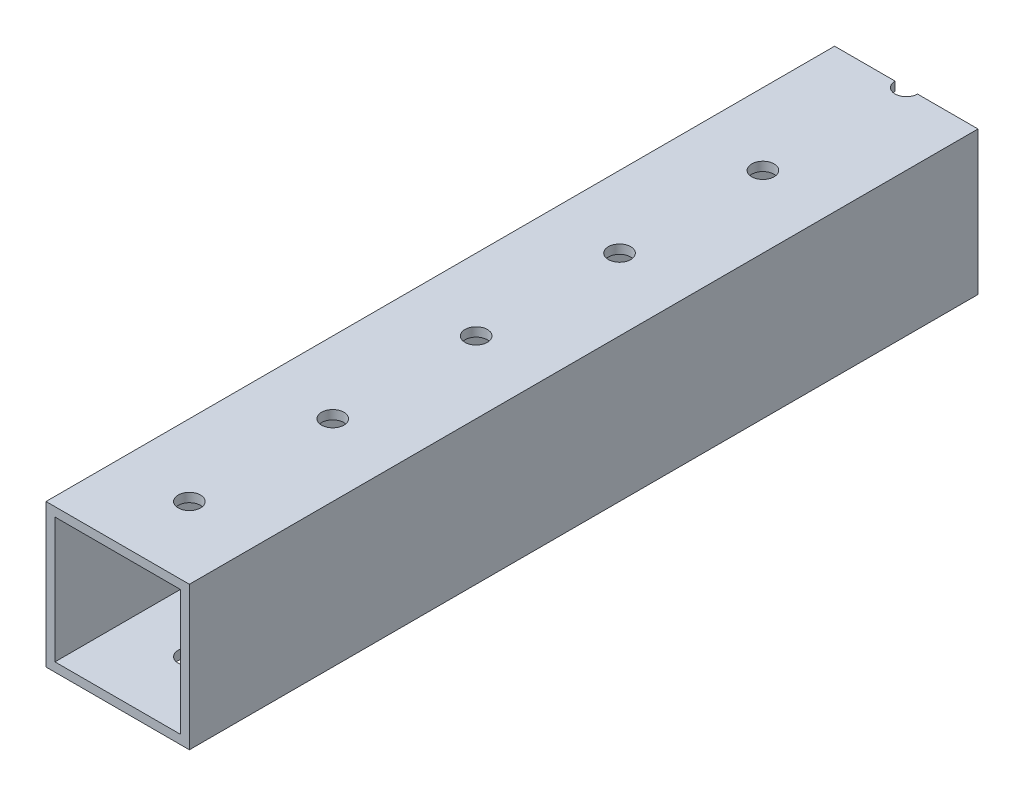
ISO-10303-21;
HEADER;
FILE_DESCRIPTION(('STEP AP214'),'2;1');
FILE_NAME('part.step','',(''),(''),'','','');
FILE_SCHEMA(('AUTOMOTIVE_DESIGN { 1 0 10303 214 1 1 1 1 }'));
ENDSEC;
DATA;
#1=APPLICATION_CONTEXT('core data for automotive mechanical design processes');
#2=APPLICATION_PROTOCOL_DEFINITION('international standard','automotive_design',2000,#1);
#3=PRODUCT_CONTEXT('',#1,'mechanical');
#4=PRODUCT('Part','Part','',(#3));
#5=PRODUCT_RELATED_PRODUCT_CATEGORY('part','',(#4));
#6=PRODUCT_DEFINITION_FORMATION('','',#4);
#7=PRODUCT_DEFINITION_CONTEXT('part definition',#1,'design');
#8=PRODUCT_DEFINITION('design','',#6,#7);
#9=PRODUCT_DEFINITION_SHAPE('','',#8);
#10=(LENGTH_UNIT() NAMED_UNIT(*) SI_UNIT(.MILLI.,.METRE.));
#11=(NAMED_UNIT(*) PLANE_ANGLE_UNIT() SI_UNIT($,.RADIAN.));
#12=(NAMED_UNIT(*) SI_UNIT($,.STERADIAN.) SOLID_ANGLE_UNIT());
#13=UNCERTAINTY_MEASURE_WITH_UNIT(LENGTH_MEASURE(1.E-05),#10,'distance_accuracy_value','');
#14=(GEOMETRIC_REPRESENTATION_CONTEXT(3) GLOBAL_UNCERTAINTY_ASSIGNED_CONTEXT((#13)) GLOBAL_UNIT_ASSIGNED_CONTEXT((#10,
#11,#12)) REPRESENTATION_CONTEXT('',''));
#15=CARTESIAN_POINT('',(0.,0.,0.));
#16=DIRECTION('',(0.,0.,1.));
#17=DIRECTION('',(1.,0.,0.));
#18=AXIS2_PLACEMENT_3D('',#15,#16,#17);
#19=CARTESIAN_POINT('',(0.,0.,0.));
#20=DIRECTION('',(0.,0.,1.));
#21=DIRECTION('',(1.,0.,0.));
#22=AXIS2_PLACEMENT_3D('',#19,#20,#21);
#23=PLANE('',#22);
#24=DIRECTION('',(1.,0.,0.));
#25=VECTOR('',#24,1.);
#26=CARTESIAN_POINT('',(-12.7,-12.7,0.));
#27=LINE('',#26,#25);
#28=CARTESIAN_POINT('',(1.98437499999955,-12.7,0.));
#29=VERTEX_POINT('',#28);
#30=CARTESIAN_POINT('',(12.7,-12.7,0.));
#31=VERTEX_POINT('',#30);
#32=EDGE_CURVE('E132',#29,#31,#27,.T.);
#33=ORIENTED_EDGE('',*,*,#32,.F.);
#34=DIRECTION('',(0.,1.,0.));
#35=VECTOR('',#34,1.);
#36=CARTESIAN_POINT('',(1.98437499999955,-12.7,0.));
#37=LINE('',#36,#35);
#38=CARTESIAN_POINT('',(1.98437499999955,-11.1125,0.));
#39=VERTEX_POINT('',#38);
#40=EDGE_CURVE('E119',#29,#39,#37,.T.);
#41=ORIENTED_EDGE('',*,*,#40,.T.);
#42=DIRECTION('',(1.,0.,0.));
#43=VECTOR('',#42,1.);
#44=CARTESIAN_POINT('',(-11.1125,-11.1125,0.));
#45=LINE('',#44,#43);
#46=CARTESIAN_POINT('',(11.1125,-11.1125,0.));
#47=VERTEX_POINT('',#46);
#48=EDGE_CURVE('E244',#39,#47,#45,.T.);
#49=ORIENTED_EDGE('',*,*,#48,.T.);
#50=DIRECTION('',(0.,1.,0.));
#51=VECTOR('',#50,1.);
#52=CARTESIAN_POINT('',(11.1125,11.1125,0.));
#53=LINE('',#52,#51);
#54=CARTESIAN_POINT('',(11.1125,11.1125,0.));
#55=VERTEX_POINT('',#54);
#56=EDGE_CURVE('E223',#47,#55,#53,.T.);
#57=ORIENTED_EDGE('',*,*,#56,.T.);
#58=DIRECTION('',(-1.,0.,0.));
#59=VECTOR('',#58,1.);
#60=CARTESIAN_POINT('',(-11.1125,11.1125,0.));
#61=LINE('',#60,#59);
#62=CARTESIAN_POINT('',(1.98437499999955,11.1125,0.));
#63=VERTEX_POINT('',#62);
#64=EDGE_CURVE('E238',#55,#63,#61,.T.);
#65=ORIENTED_EDGE('',*,*,#64,.T.);
#66=CARTESIAN_POINT('',(1.98437499999955,12.7,0.));
#67=VERTEX_POINT('',#66);
#68=EDGE_CURVE('E48',#63,#67,#37,.T.);
#69=ORIENTED_EDGE('',*,*,#68,.T.);
#70=DIRECTION('',(-1.,0.,0.));
#71=VECTOR('',#70,1.);
#72=CARTESIAN_POINT('',(-12.7,12.7,0.));
#73=LINE('',#72,#71);
#74=CARTESIAN_POINT('',(12.7,12.7,0.));
#75=VERTEX_POINT('',#74);
#76=EDGE_CURVE('E145',#75,#67,#73,.T.);
#77=ORIENTED_EDGE('',*,*,#76,.F.);
#78=DIRECTION('',(0.,1.,0.));
#79=VECTOR('',#78,1.);
#80=CARTESIAN_POINT('',(12.7,12.7,0.));
#81=LINE('',#80,#79);
#82=EDGE_CURVE('E141',#31,#75,#81,.T.);
#83=ORIENTED_EDGE('',*,*,#82,.F.);
#84=EDGE_LOOP('',(#33,#41,#49,#57,#65,#69,#77,#83));
#85=FACE_BOUND('',#84,.T.);
#86=ADVANCED_FACE('F33',(#85),#23,.F.);
#87=CARTESIAN_POINT('',(0.,0.,139.7));
#88=DIRECTION('',(0.,0.,1.));
#89=DIRECTION('',(1.,0.,0.));
#90=AXIS2_PLACEMENT_3D('',#87,#88,#89);
#91=PLANE('',#90);
#92=DIRECTION('',(0.,1.,0.));
#93=VECTOR('',#92,1.);
#94=CARTESIAN_POINT('',(12.7,12.7,139.7));
#95=LINE('',#94,#93);
#96=CARTESIAN_POINT('',(12.7,-12.7,139.7));
#97=VERTEX_POINT('',#96);
#98=CARTESIAN_POINT('',(12.7,12.7,139.7));
#99=VERTEX_POINT('',#98);
#100=EDGE_CURVE('E144',#97,#99,#95,.T.);
#101=ORIENTED_EDGE('',*,*,#100,.T.);
#102=DIRECTION('',(-1.,0.,0.));
#103=VECTOR('',#102,1.);
#104=CARTESIAN_POINT('',(-12.7,12.7,139.7));
#105=LINE('',#104,#103);
#106=CARTESIAN_POINT('',(-12.7,12.7,139.7));
#107=VERTEX_POINT('',#106);
#108=EDGE_CURVE('E259',#99,#107,#105,.T.);
#109=ORIENTED_EDGE('',*,*,#108,.T.);
#110=DIRECTION('',(0.,-1.,0.));
#111=VECTOR('',#110,1.);
#112=CARTESIAN_POINT('',(-12.7,12.7,139.7));
#113=LINE('',#112,#111);
#114=CARTESIAN_POINT('',(-12.7,-12.7,139.7));
#115=VERTEX_POINT('',#114);
#116=EDGE_CURVE('E261',#107,#115,#113,.T.);
#117=ORIENTED_EDGE('',*,*,#116,.T.);
#118=DIRECTION('',(1.,0.,0.));
#119=VECTOR('',#118,1.);
#120=CARTESIAN_POINT('',(-12.7,-12.7,139.7));
#121=LINE('',#120,#119);
#122=EDGE_CURVE('E152',#115,#97,#121,.T.);
#123=ORIENTED_EDGE('',*,*,#122,.T.);
#124=EDGE_LOOP('',(#101,#109,#117,#123));
#125=FACE_BOUND('',#124,.T.);
#126=DIRECTION('',(-1.,0.,0.));
#127=VECTOR('',#126,1.);
#128=CARTESIAN_POINT('',(-11.1125,11.1125,139.7));
#129=LINE('',#128,#127);
#130=CARTESIAN_POINT('',(11.1125,11.1125,139.7));
#131=VERTEX_POINT('',#130);
#132=CARTESIAN_POINT('',(-11.1125,11.1125,139.7));
#133=VERTEX_POINT('',#132);
#134=EDGE_CURVE('E226',#131,#133,#129,.T.);
#135=ORIENTED_EDGE('',*,*,#134,.F.);
#136=DIRECTION('',(0.,1.,0.));
#137=VECTOR('',#136,1.);
#138=CARTESIAN_POINT('',(11.1125,11.1125,139.7));
#139=LINE('',#138,#137);
#140=CARTESIAN_POINT('',(11.1125,-11.1125,139.7));
#141=VERTEX_POINT('',#140);
#142=EDGE_CURVE('E224',#141,#131,#139,.T.);
#143=ORIENTED_EDGE('',*,*,#142,.F.);
#144=DIRECTION('',(1.,0.,0.));
#145=VECTOR('',#144,1.);
#146=CARTESIAN_POINT('',(-11.1125,-11.1125,139.7));
#147=LINE('',#146,#145);
#148=CARTESIAN_POINT('',(-11.1125,-11.1125,139.7));
#149=VERTEX_POINT('',#148);
#150=EDGE_CURVE('E232',#149,#141,#147,.T.);
#151=ORIENTED_EDGE('',*,*,#150,.F.);
#152=DIRECTION('',(0.,-1.,0.));
#153=VECTOR('',#152,1.);
#154=CARTESIAN_POINT('',(-11.1125,11.1125,139.7));
#155=LINE('',#154,#153);
#156=EDGE_CURVE('E229',#133,#149,#155,.T.);
#157=ORIENTED_EDGE('',*,*,#156,.F.);
#158=EDGE_LOOP('',(#135,#143,#151,#157));
#159=FACE_BOUND('',#158,.T.);
#160=ADVANCED_FACE('F301',(#125,#159),#91,.T.);
#161=CARTESIAN_POINT('',(-1.98437500000044,12.7,0.));
#162=VERTEX_POINT('',#161);
#163=CARTESIAN_POINT('',(-12.7,12.7,0.));
#164=VERTEX_POINT('',#163);
#165=EDGE_CURVE('E264',#162,#164,#73,.T.);
#166=ORIENTED_EDGE('',*,*,#165,.F.);
#167=DIRECTION('',(0.,1.,0.));
#168=VECTOR('',#167,1.);
#169=CARTESIAN_POINT('',(-1.98437500000044,-12.7,0.));
#170=LINE('',#169,#168);
#171=CARTESIAN_POINT('',(-1.98437500000044,11.1125,0.));
#172=VERTEX_POINT('',#171);
#173=EDGE_CURVE('E281',#162,#172,#170,.F.);
#174=ORIENTED_EDGE('',*,*,#173,.T.);
#175=CARTESIAN_POINT('',(-11.1125,11.1125,0.));
#176=VERTEX_POINT('',#175);
#177=EDGE_CURVE('E237',#172,#176,#61,.T.);
#178=ORIENTED_EDGE('',*,*,#177,.T.);
#179=DIRECTION('',(0.,-1.,0.));
#180=VECTOR('',#179,1.);
#181=CARTESIAN_POINT('',(-11.1125,11.1125,0.));
#182=LINE('',#181,#180);
#183=CARTESIAN_POINT('',(-11.1125,-11.1125,0.));
#184=VERTEX_POINT('',#183);
#185=EDGE_CURVE('E241',#176,#184,#182,.T.);
#186=ORIENTED_EDGE('',*,*,#185,.T.);
#187=CARTESIAN_POINT('',(-1.98437500000044,-11.1125,0.));
#188=VERTEX_POINT('',#187);
#189=EDGE_CURVE('E227',#184,#188,#45,.T.);
#190=ORIENTED_EDGE('',*,*,#189,.T.);
#191=CARTESIAN_POINT('',(-1.98437500000044,-12.7,0.));
#192=VERTEX_POINT('',#191);
#193=EDGE_CURVE('E55',#188,#192,#170,.F.);
#194=ORIENTED_EDGE('',*,*,#193,.T.);
#195=CARTESIAN_POINT('',(-12.7,-12.7,0.));
#196=VERTEX_POINT('',#195);
#197=EDGE_CURVE('E136',#196,#192,#27,.T.);
#198=ORIENTED_EDGE('',*,*,#197,.F.);
#199=DIRECTION('',(0.,-1.,0.));
#200=VECTOR('',#199,1.);
#201=CARTESIAN_POINT('',(-12.7,12.7,0.));
#202=LINE('',#201,#200);
#203=EDGE_CURVE('E142',#164,#196,#202,.T.);
#204=ORIENTED_EDGE('',*,*,#203,.F.);
#205=EDGE_LOOP('',(#166,#174,#178,#186,#190,#194,#198,#204));
#206=FACE_BOUND('',#205,.T.);
#207=ADVANCED_FACE('F278',(#206),#23,.F.);
#208=CARTESIAN_POINT('',(12.7,12.7,139.7));
#209=DIRECTION('',(-1.,0.,0.));
#210=DIRECTION('',(0.,-1.,0.));
#211=AXIS2_PLACEMENT_3D('',#208,#209,#210);
#212=PLANE('',#211);
#213=ORIENTED_EDGE('',*,*,#82,.T.);
#214=DIRECTION('',(0.,0.,-1.));
#215=VECTOR('',#214,1.);
#216=CARTESIAN_POINT('',(12.7,12.7,139.7));
#217=LINE('',#216,#215);
#218=EDGE_CURVE('E41',#99,#75,#217,.T.);
#219=ORIENTED_EDGE('',*,*,#218,.F.);
#220=ORIENTED_EDGE('',*,*,#100,.F.);
#221=DIRECTION('',(0.,0.,-1.));
#222=VECTOR('',#221,1.);
#223=CARTESIAN_POINT('',(12.7,-12.7,139.7));
#224=LINE('',#223,#222);
#225=EDGE_CURVE('E149',#97,#31,#224,.T.);
#226=ORIENTED_EDGE('',*,*,#225,.T.);
#227=EDGE_LOOP('',(#213,#219,#220,#226));
#228=FACE_BOUND('',#227,.T.);
#229=ADVANCED_FACE('F35',(#228),#212,.F.);
#230=CARTESIAN_POINT('',(-12.7,12.7,139.7));
#231=DIRECTION('',(0.,-1.,0.));
#232=DIRECTION('',(0.,0.,-1.));
#233=AXIS2_PLACEMENT_3D('',#230,#231,#232);
#234=PLANE('',#233);
#235=CARTESIAN_POINT('',(-3.54734504026462E-13,12.7,25.4000000000001));
#236=DIRECTION('',(0.,1.,0.));
#237=DIRECTION('',(0.,0.,1.));
#238=AXIS2_PLACEMENT_3D('',#235,#236,#237);
#239=CIRCLE('',#238,1.98437499999999);
#240=CARTESIAN_POINT('',(-3.54734504026462E-13,12.7,27.3843750000001));
#241=VERTEX_POINT('',#240);
#242=EDGE_CURVE('E188',#241,#241,#239,.T.);
#243=ORIENTED_EDGE('',*,*,#242,.F.);
#244=EDGE_LOOP('',(#243));
#245=FACE_BOUND('',#244,.T.);
#246=CARTESIAN_POINT('',(-2.66050878019846E-13,12.7,50.8000000000001));
#247=DIRECTION('',(0.,1.,0.));
#248=DIRECTION('',(0.,0.,1.));
#249=AXIS2_PLACEMENT_3D('',#246,#247,#248);
#250=CIRCLE('',#249,1.98437499999999);
#251=CARTESIAN_POINT('',(-2.66050878019846E-13,12.7,52.7843750000001));
#252=VERTEX_POINT('',#251);
#253=EDGE_CURVE('E185',#252,#252,#250,.T.);
#254=ORIENTED_EDGE('',*,*,#253,.F.);
#255=EDGE_LOOP('',(#254));
#256=FACE_BOUND('',#255,.T.);
#257=CARTESIAN_POINT('',(-1.77367252013231E-13,12.7,76.2));
#258=DIRECTION('',(0.,1.,0.));
#259=DIRECTION('',(0.,0.,1.));
#260=AXIS2_PLACEMENT_3D('',#257,#258,#259);
#261=CIRCLE('',#260,1.98437499999999);
#262=CARTESIAN_POINT('',(-1.77367252013231E-13,12.7,78.184375));
#263=VERTEX_POINT('',#262);
#264=EDGE_CURVE('E202',#263,#263,#261,.T.);
#265=ORIENTED_EDGE('',*,*,#264,.F.);
#266=EDGE_LOOP('',(#265));
#267=FACE_BOUND('',#266,.T.);
#268=CARTESIAN_POINT('',(0.,12.7,101.6));
#269=DIRECTION('',(0.,1.,0.));
#270=DIRECTION('',(0.,0.,1.));
#271=AXIS2_PLACEMENT_3D('',#268,#269,#270);
#272=CIRCLE('',#271,1.984375);
#273=CARTESIAN_POINT('',(0.,12.7,103.584375));
#274=VERTEX_POINT('',#273);
#275=EDGE_CURVE('E209',#274,#274,#272,.T.);
#276=ORIENTED_EDGE('',*,*,#275,.F.);
#277=EDGE_LOOP('',(#276));
#278=FACE_BOUND('',#277,.T.);
#279=CARTESIAN_POINT('',(0.,12.7,127.));
#280=DIRECTION('',(0.,1.,0.));
#281=DIRECTION('',(0.,0.,1.));
#282=AXIS2_PLACEMENT_3D('',#279,#280,#281);
#283=CIRCLE('',#282,1.98437500000001);
#284=CARTESIAN_POINT('',(0.,12.7,128.984375));
#285=VERTEX_POINT('',#284);
#286=EDGE_CURVE('E216',#285,#285,#283,.T.);
#287=ORIENTED_EDGE('',*,*,#286,.F.);
#288=EDGE_LOOP('',(#287));
#289=FACE_BOUND('',#288,.T.);
#290=ORIENTED_EDGE('',*,*,#76,.T.);
#291=CARTESIAN_POINT('',(-4.43418130033078E-13,12.7,1.11022302462516E-13));
#292=DIRECTION('',(0.,1.,0.));
#293=DIRECTION('',(0.,0.,1.));
#294=AXIS2_PLACEMENT_3D('',#291,#292,#293);
#295=CIRCLE('',#294,1.98437499999999);
#296=EDGE_CURVE('E137',#162,#67,#295,.T.);
#297=ORIENTED_EDGE('',*,*,#296,.F.);
#298=ORIENTED_EDGE('',*,*,#165,.T.);
#299=DIRECTION('',(0.,0.,-1.));
#300=VECTOR('',#299,1.);
#301=CARTESIAN_POINT('',(-12.7,12.7,139.7));
#302=LINE('',#301,#300);
#303=EDGE_CURVE('E154',#107,#164,#302,.T.);
#304=ORIENTED_EDGE('',*,*,#303,.F.);
#305=ORIENTED_EDGE('',*,*,#108,.F.);
#306=ORIENTED_EDGE('',*,*,#218,.T.);
#307=EDGE_LOOP('',(#290,#297,#298,#304,#305,#306));
#308=FACE_BOUND('',#307,.T.);
#309=ADVANCED_FACE('F270',(#245,#256,#267,#278,#289,#308),#234,.F.);
#310=CARTESIAN_POINT('',(-12.7,12.7,139.7));
#311=DIRECTION('',(1.,0.,0.));
#312=DIRECTION('',(0.,1.,0.));
#313=AXIS2_PLACEMENT_3D('',#310,#311,#312);
#314=PLANE('',#313);
#315=ORIENTED_EDGE('',*,*,#203,.T.);
#316=DIRECTION('',(0.,0.,-1.));
#317=VECTOR('',#316,1.);
#318=CARTESIAN_POINT('',(-12.7,-12.7,139.7));
#319=LINE('',#318,#317);
#320=EDGE_CURVE('E151',#115,#196,#319,.T.);
#321=ORIENTED_EDGE('',*,*,#320,.F.);
#322=ORIENTED_EDGE('',*,*,#116,.F.);
#323=ORIENTED_EDGE('',*,*,#303,.T.);
#324=EDGE_LOOP('',(#315,#321,#322,#323));
#325=FACE_BOUND('',#324,.T.);
#326=ADVANCED_FACE('F276',(#325),#314,.F.);
#327=CARTESIAN_POINT('',(-12.7,-12.7,139.7));
#328=DIRECTION('',(0.,1.,0.));
#329=DIRECTION('',(0.,0.,1.));
#330=AXIS2_PLACEMENT_3D('',#327,#328,#329);
#331=PLANE('',#330);
#332=CARTESIAN_POINT('',(-3.54734504026462E-13,-12.7,25.4000000000001));
#333=DIRECTION('',(0.,1.,0.));
#334=DIRECTION('',(0.,0.,1.));
#335=AXIS2_PLACEMENT_3D('',#332,#333,#334);
#336=CIRCLE('',#335,1.98437499999999);
#337=CARTESIAN_POINT('',(-3.54734504026462E-13,-12.7,27.3843750000001));
#338=VERTEX_POINT('',#337);
#339=EDGE_CURVE('E181',#338,#338,#336,.T.);
#340=ORIENTED_EDGE('',*,*,#339,.T.);
#341=EDGE_LOOP('',(#340));
#342=FACE_BOUND('',#341,.T.);
#343=CARTESIAN_POINT('',(-2.66050878019846E-13,-12.7,50.8000000000001));
#344=DIRECTION('',(0.,1.,0.));
#345=DIRECTION('',(0.,0.,1.));
#346=AXIS2_PLACEMENT_3D('',#343,#344,#345);
#347=CIRCLE('',#346,1.98437499999999);
#348=CARTESIAN_POINT('',(-2.66050878019846E-13,-12.7,52.7843750000001));
#349=VERTEX_POINT('',#348);
#350=EDGE_CURVE('E177',#349,#349,#347,.T.);
#351=ORIENTED_EDGE('',*,*,#350,.T.);
#352=EDGE_LOOP('',(#351));
#353=FACE_BOUND('',#352,.T.);
#354=CARTESIAN_POINT('',(-1.77367252013231E-13,-12.7,76.2));
#355=DIRECTION('',(0.,1.,0.));
#356=DIRECTION('',(0.,0.,1.));
#357=AXIS2_PLACEMENT_3D('',#354,#355,#356);
#358=CIRCLE('',#357,1.98437499999999);
#359=CARTESIAN_POINT('',(-1.77367252013231E-13,-12.7,78.184375));
#360=VERTEX_POINT('',#359);
#361=EDGE_CURVE('E173',#360,#360,#358,.T.);
#362=ORIENTED_EDGE('',*,*,#361,.T.);
#363=EDGE_LOOP('',(#362));
#364=FACE_BOUND('',#363,.T.);
#365=CARTESIAN_POINT('',(0.,-12.7,101.6));
#366=DIRECTION('',(0.,1.,0.));
#367=DIRECTION('',(0.,0.,1.));
#368=AXIS2_PLACEMENT_3D('',#365,#366,#367);
#369=CIRCLE('',#368,1.984375);
#370=CARTESIAN_POINT('',(0.,-12.7,103.584375));
#371=VERTEX_POINT('',#370);
#372=EDGE_CURVE('E168',#371,#371,#369,.T.);
#373=ORIENTED_EDGE('',*,*,#372,.T.);
#374=EDGE_LOOP('',(#373));
#375=FACE_BOUND('',#374,.T.);
#376=CARTESIAN_POINT('',(0.,-12.7,127.));
#377=DIRECTION('',(0.,1.,0.));
#378=DIRECTION('',(0.,0.,1.));
#379=AXIS2_PLACEMENT_3D('',#376,#377,#378);
#380=CIRCLE('',#379,1.98437500000001);
#381=CARTESIAN_POINT('',(0.,-12.7,128.984375));
#382=VERTEX_POINT('',#381);
#383=EDGE_CURVE('E163',#382,#382,#380,.T.);
#384=ORIENTED_EDGE('',*,*,#383,.T.);
#385=EDGE_LOOP('',(#384));
#386=FACE_BOUND('',#385,.T.);
#387=ORIENTED_EDGE('',*,*,#197,.T.);
#388=CARTESIAN_POINT('',(-4.43418130033078E-13,-12.7,1.11022302462516E-13));
#389=DIRECTION('',(0.,1.,0.));
#390=DIRECTION('',(0.,0.,1.));
#391=AXIS2_PLACEMENT_3D('',#388,#389,#390);
#392=CIRCLE('',#391,1.98437499999999);
#393=EDGE_CURVE('E122',#192,#29,#392,.T.);
#394=ORIENTED_EDGE('',*,*,#393,.T.);
#395=ORIENTED_EDGE('',*,*,#32,.T.);
#396=ORIENTED_EDGE('',*,*,#225,.F.);
#397=ORIENTED_EDGE('',*,*,#122,.F.);
#398=ORIENTED_EDGE('',*,*,#320,.T.);
#399=EDGE_LOOP('',(#387,#394,#395,#396,#397,#398));
#400=FACE_BOUND('',#399,.T.);
#401=ADVANCED_FACE('F130',(#342,#353,#364,#375,#386,#400),#331,.F.);
#402=CARTESIAN_POINT('',(11.1125,11.1125,139.7));
#403=DIRECTION('',(-1.,0.,0.));
#404=DIRECTION('',(0.,0.,1.));
#405=AXIS2_PLACEMENT_3D('',#402,#403,#404);
#406=PLANE('',#405);
#407=ORIENTED_EDGE('',*,*,#56,.F.);
#408=DIRECTION('',(0.,0.,-1.));
#409=VECTOR('',#408,1.);
#410=CARTESIAN_POINT('',(11.1125,-11.1125,139.7));
#411=LINE('',#410,#409);
#412=EDGE_CURVE('E234',#141,#47,#411,.T.);
#413=ORIENTED_EDGE('',*,*,#412,.F.);
#414=ORIENTED_EDGE('',*,*,#142,.T.);
#415=DIRECTION('',(0.,0.,-1.));
#416=VECTOR('',#415,1.);
#417=CARTESIAN_POINT('',(11.1125,11.1125,139.7));
#418=LINE('',#417,#416);
#419=EDGE_CURVE('E254',#131,#55,#418,.T.);
#420=ORIENTED_EDGE('',*,*,#419,.T.);
#421=EDGE_LOOP('',(#407,#413,#414,#420));
#422=FACE_BOUND('',#421,.T.);
#423=ADVANCED_FACE('F292',(#422),#406,.T.);
#424=CARTESIAN_POINT('',(-11.1125,11.1125,139.7));
#425=DIRECTION('',(0.,-1.,0.));
#426=DIRECTION('',(0.,0.,-1.));
#427=AXIS2_PLACEMENT_3D('',#424,#425,#426);
#428=PLANE('',#427);
#429=CARTESIAN_POINT('',(-4.43418130033078E-13,11.1125,1.11022302462516E-13));
#430=DIRECTION('',(0.,-1.,0.));
#431=DIRECTION('',(0.,0.,-1.));
#432=AXIS2_PLACEMENT_3D('',#429,#430,#431);
#433=CIRCLE('',#432,1.98437499999999);
#434=EDGE_CURVE('E126',#63,#172,#433,.T.);
#435=ORIENTED_EDGE('',*,*,#434,.F.);
#436=ORIENTED_EDGE('',*,*,#64,.F.);
#437=ORIENTED_EDGE('',*,*,#419,.F.);
#438=ORIENTED_EDGE('',*,*,#134,.T.);
#439=DIRECTION('',(0.,0.,-1.));
#440=VECTOR('',#439,1.);
#441=CARTESIAN_POINT('',(-11.1125,11.1125,139.7));
#442=LINE('',#441,#440);
#443=EDGE_CURVE('E251',#133,#176,#442,.T.);
#444=ORIENTED_EDGE('',*,*,#443,.T.);
#445=ORIENTED_EDGE('',*,*,#177,.F.);
#446=EDGE_LOOP('',(#435,#436,#437,#438,#444,#445));
#447=FACE_BOUND('',#446,.T.);
#448=CARTESIAN_POINT('',(-3.54734504026462E-13,11.1125,25.4000000000001));
#449=DIRECTION('',(0.,-1.,0.));
#450=DIRECTION('',(0.,0.,-1.));
#451=AXIS2_PLACEMENT_3D('',#448,#449,#450);
#452=CIRCLE('',#451,1.98437499999999);
#453=CARTESIAN_POINT('',(-3.54734504026462E-13,11.1125,23.4156250000001));
#454=VERTEX_POINT('',#453);
#455=EDGE_CURVE('E180',#454,#454,#452,.T.);
#456=ORIENTED_EDGE('',*,*,#455,.F.);
#457=EDGE_LOOP('',(#456));
#458=FACE_BOUND('',#457,.T.);
#459=CARTESIAN_POINT('',(-2.66050878019846E-13,11.1125,50.8000000000001));
#460=DIRECTION('',(0.,-1.,0.));
#461=DIRECTION('',(0.,0.,-1.));
#462=AXIS2_PLACEMENT_3D('',#459,#460,#461);
#463=CIRCLE('',#462,1.98437499999999);
#464=CARTESIAN_POINT('',(-2.66050878019846E-13,11.1125,48.8156250000001));
#465=VERTEX_POINT('',#464);
#466=EDGE_CURVE('E176',#465,#465,#463,.T.);
#467=ORIENTED_EDGE('',*,*,#466,.F.);
#468=EDGE_LOOP('',(#467));
#469=FACE_BOUND('',#468,.T.);
#470=CARTESIAN_POINT('',(-1.77367252013231E-13,11.1125,76.2));
#471=DIRECTION('',(0.,-1.,0.));
#472=DIRECTION('',(0.,0.,-1.));
#473=AXIS2_PLACEMENT_3D('',#470,#471,#472);
#474=CIRCLE('',#473,1.98437499999999);
#475=CARTESIAN_POINT('',(-1.77367252013231E-13,11.1125,74.215625));
#476=VERTEX_POINT('',#475);
#477=EDGE_CURVE('E172',#476,#476,#474,.T.);
#478=ORIENTED_EDGE('',*,*,#477,.F.);
#479=EDGE_LOOP('',(#478));
#480=FACE_BOUND('',#479,.T.);
#481=CARTESIAN_POINT('',(0.,11.1125,101.6));
#482=DIRECTION('',(0.,-1.,0.));
#483=DIRECTION('',(0.,0.,-1.));
#484=AXIS2_PLACEMENT_3D('',#481,#482,#483);
#485=CIRCLE('',#484,1.984375);
#486=CARTESIAN_POINT('',(0.,11.1125,99.615625));
#487=VERTEX_POINT('',#486);
#488=EDGE_CURVE('E167',#487,#487,#485,.T.);
#489=ORIENTED_EDGE('',*,*,#488,.F.);
#490=EDGE_LOOP('',(#489));
#491=FACE_BOUND('',#490,.T.);
#492=CARTESIAN_POINT('',(0.,11.1125,127.));
#493=DIRECTION('',(0.,-1.,0.));
#494=DIRECTION('',(0.,0.,-1.));
#495=AXIS2_PLACEMENT_3D('',#492,#493,#494);
#496=CIRCLE('',#495,1.98437500000001);
#497=CARTESIAN_POINT('',(0.,11.1125,125.015625));
#498=VERTEX_POINT('',#497);
#499=EDGE_CURVE('E162',#498,#498,#496,.T.);
#500=ORIENTED_EDGE('',*,*,#499,.F.);
#501=EDGE_LOOP('',(#500));
#502=FACE_BOUND('',#501,.T.);
#503=ADVANCED_FACE('F286',(#447,#458,#469,#480,#491,#502),#428,.T.);
#504=CARTESIAN_POINT('',(-11.1125,11.1125,139.7));
#505=DIRECTION('',(1.,0.,0.));
#506=DIRECTION('',(0.,1.,0.));
#507=AXIS2_PLACEMENT_3D('',#504,#505,#506);
#508=PLANE('',#507);
#509=ORIENTED_EDGE('',*,*,#185,.F.);
#510=ORIENTED_EDGE('',*,*,#443,.F.);
#511=ORIENTED_EDGE('',*,*,#156,.T.);
#512=DIRECTION('',(0.,0.,-1.));
#513=VECTOR('',#512,1.);
#514=CARTESIAN_POINT('',(-11.1125,-11.1125,139.7));
#515=LINE('',#514,#513);
#516=EDGE_CURVE('E249',#149,#184,#515,.T.);
#517=ORIENTED_EDGE('',*,*,#516,.T.);
#518=EDGE_LOOP('',(#509,#510,#511,#517));
#519=FACE_BOUND('',#518,.T.);
#520=ADVANCED_FACE('F305',(#519),#508,.T.);
#521=CARTESIAN_POINT('',(-11.1125,-11.1125,139.7));
#522=DIRECTION('',(0.,1.,0.));
#523=DIRECTION('',(0.,0.,1.));
#524=AXIS2_PLACEMENT_3D('',#521,#522,#523);
#525=PLANE('',#524);
#526=CARTESIAN_POINT('',(-4.43418130033078E-13,-11.1125,1.11022302462516E-13));
#527=DIRECTION('',(0.,1.,0.));
#528=DIRECTION('',(0.,0.,1.));
#529=AXIS2_PLACEMENT_3D('',#526,#527,#528);
#530=CIRCLE('',#529,1.98437499999999);
#531=EDGE_CURVE('E11',#188,#39,#530,.T.);
#532=ORIENTED_EDGE('',*,*,#531,.F.);
#533=ORIENTED_EDGE('',*,*,#189,.F.);
#534=ORIENTED_EDGE('',*,*,#516,.F.);
#535=ORIENTED_EDGE('',*,*,#150,.T.);
#536=ORIENTED_EDGE('',*,*,#412,.T.);
#537=ORIENTED_EDGE('',*,*,#48,.F.);
#538=EDGE_LOOP('',(#532,#533,#534,#535,#536,#537));
#539=FACE_BOUND('',#538,.T.);
#540=CARTESIAN_POINT('',(-3.54734504026462E-13,-11.1125,25.4000000000001));
#541=DIRECTION('',(0.,1.,0.));
#542=DIRECTION('',(0.,0.,1.));
#543=AXIS2_PLACEMENT_3D('',#540,#541,#542);
#544=CIRCLE('',#543,1.98437499999999);
#545=CARTESIAN_POINT('',(-3.54734504026462E-13,-11.1125,27.3843750000001));
#546=VERTEX_POINT('',#545);
#547=EDGE_CURVE('E178',#546,#546,#544,.T.);
#548=ORIENTED_EDGE('',*,*,#547,.F.);
#549=EDGE_LOOP('',(#548));
#550=FACE_BOUND('',#549,.T.);
#551=CARTESIAN_POINT('',(-2.66050878019846E-13,-11.1125,50.8000000000001));
#552=DIRECTION('',(0.,1.,0.));
#553=DIRECTION('',(0.,0.,1.));
#554=AXIS2_PLACEMENT_3D('',#551,#552,#553);
#555=CIRCLE('',#554,1.98437499999999);
#556=CARTESIAN_POINT('',(-2.66050878019846E-13,-11.1125,52.7843750000001));
#557=VERTEX_POINT('',#556);
#558=EDGE_CURVE('E174',#557,#557,#555,.T.);
#559=ORIENTED_EDGE('',*,*,#558,.F.);
#560=EDGE_LOOP('',(#559));
#561=FACE_BOUND('',#560,.T.);
#562=CARTESIAN_POINT('',(-1.77367252013231E-13,-11.1125,76.2));
#563=DIRECTION('',(0.,1.,0.));
#564=DIRECTION('',(0.,0.,1.));
#565=AXIS2_PLACEMENT_3D('',#562,#563,#564);
#566=CIRCLE('',#565,1.98437499999999);
#567=CARTESIAN_POINT('',(-1.77367252013231E-13,-11.1125,78.184375));
#568=VERTEX_POINT('',#567);
#569=EDGE_CURVE('E169',#568,#568,#566,.T.);
#570=ORIENTED_EDGE('',*,*,#569,.F.);
#571=EDGE_LOOP('',(#570));
#572=FACE_BOUND('',#571,.T.);
#573=CARTESIAN_POINT('',(0.,-11.1125,101.6));
#574=DIRECTION('',(0.,1.,0.));
#575=DIRECTION('',(0.,0.,1.));
#576=AXIS2_PLACEMENT_3D('',#573,#574,#575);
#577=CIRCLE('',#576,1.984375);
#578=CARTESIAN_POINT('',(0.,-11.1125,103.584375));
#579=VERTEX_POINT('',#578);
#580=EDGE_CURVE('E164',#579,#579,#577,.T.);
#581=ORIENTED_EDGE('',*,*,#580,.F.);
#582=EDGE_LOOP('',(#581));
#583=FACE_BOUND('',#582,.T.);
#584=CARTESIAN_POINT('',(0.,-11.1125,127.));
#585=DIRECTION('',(0.,1.,0.));
#586=DIRECTION('',(0.,0.,1.));
#587=AXIS2_PLACEMENT_3D('',#584,#585,#586);
#588=CIRCLE('',#587,1.98437500000001);
#589=CARTESIAN_POINT('',(0.,-11.1125,128.984375));
#590=VERTEX_POINT('',#589);
#591=EDGE_CURVE('E159',#590,#590,#588,.T.);
#592=ORIENTED_EDGE('',*,*,#591,.F.);
#593=EDGE_LOOP('',(#592));
#594=FACE_BOUND('',#593,.T.);
#595=ADVANCED_FACE('F295',(#539,#550,#561,#572,#583,#594),#525,.T.);
#596=CARTESIAN_POINT('',(0.,-12.7,127.));
#597=DIRECTION('',(0.,1.,0.));
#598=DIRECTION('',(0.,0.,1.));
#599=AXIS2_PLACEMENT_3D('',#596,#597,#598);
#600=CYLINDRICAL_SURFACE('',#599,1.98437500000001);
#601=ORIENTED_EDGE('',*,*,#591,.T.);
#602=EDGE_LOOP('',(#601));
#603=FACE_BOUND('',#602,.T.);
#604=ORIENTED_EDGE('',*,*,#383,.F.);
#605=EDGE_LOOP('',(#604));
#606=FACE_BOUND('',#605,.T.);
#607=ADVANCED_FACE('F312',(#603,#606),#600,.F.);
#608=ORIENTED_EDGE('',*,*,#499,.T.);
#609=EDGE_LOOP('',(#608));
#610=FACE_BOUND('',#609,.T.);
#611=ORIENTED_EDGE('',*,*,#286,.T.);
#612=EDGE_LOOP('',(#611));
#613=FACE_BOUND('',#612,.T.);
#614=ADVANCED_FACE('F356',(#610,#613),#600,.F.);
#615=CARTESIAN_POINT('',(0.,-12.7,101.6));
#616=DIRECTION('',(0.,1.,0.));
#617=DIRECTION('',(0.,0.,1.));
#618=AXIS2_PLACEMENT_3D('',#615,#616,#617);
#619=CYLINDRICAL_SURFACE('',#618,1.984375);
#620=ORIENTED_EDGE('',*,*,#580,.T.);
#621=EDGE_LOOP('',(#620));
#622=FACE_BOUND('',#621,.T.);
#623=ORIENTED_EDGE('',*,*,#372,.F.);
#624=EDGE_LOOP('',(#623));
#625=FACE_BOUND('',#624,.T.);
#626=ADVANCED_FACE('F362',(#622,#625),#619,.F.);
#627=ORIENTED_EDGE('',*,*,#488,.T.);
#628=EDGE_LOOP('',(#627));
#629=FACE_BOUND('',#628,.T.);
#630=ORIENTED_EDGE('',*,*,#275,.T.);
#631=EDGE_LOOP('',(#630));
#632=FACE_BOUND('',#631,.T.);
#633=ADVANCED_FACE('F367',(#629,#632),#619,.F.);
#634=CARTESIAN_POINT('',(-1.77367252013231E-13,-12.7,76.2));
#635=DIRECTION('',(0.,1.,0.));
#636=DIRECTION('',(0.,0.,1.));
#637=AXIS2_PLACEMENT_3D('',#634,#635,#636);
#638=CYLINDRICAL_SURFACE('',#637,1.98437499999999);
#639=ORIENTED_EDGE('',*,*,#569,.T.);
#640=EDGE_LOOP('',(#639));
#641=FACE_BOUND('',#640,.T.);
#642=ORIENTED_EDGE('',*,*,#361,.F.);
#643=EDGE_LOOP('',(#642));
#644=FACE_BOUND('',#643,.T.);
#645=ADVANCED_FACE('F369',(#641,#644),#638,.F.);
#646=ORIENTED_EDGE('',*,*,#477,.T.);
#647=EDGE_LOOP('',(#646));
#648=FACE_BOUND('',#647,.T.);
#649=ORIENTED_EDGE('',*,*,#264,.T.);
#650=EDGE_LOOP('',(#649));
#651=FACE_BOUND('',#650,.T.);
#652=ADVANCED_FACE('F372',(#648,#651),#638,.F.);
#653=CARTESIAN_POINT('',(-2.66050878019846E-13,-12.7,50.8000000000001));
#654=DIRECTION('',(0.,1.,0.));
#655=DIRECTION('',(0.,0.,1.));
#656=AXIS2_PLACEMENT_3D('',#653,#654,#655);
#657=CYLINDRICAL_SURFACE('',#656,1.98437499999999);
#658=ORIENTED_EDGE('',*,*,#558,.T.);
#659=EDGE_LOOP('',(#658));
#660=FACE_BOUND('',#659,.T.);
#661=ORIENTED_EDGE('',*,*,#350,.F.);
#662=EDGE_LOOP('',(#661));
#663=FACE_BOUND('',#662,.T.);
#664=ADVANCED_FACE('F374',(#660,#663),#657,.F.);
#665=ORIENTED_EDGE('',*,*,#466,.T.);
#666=EDGE_LOOP('',(#665));
#667=FACE_BOUND('',#666,.T.);
#668=ORIENTED_EDGE('',*,*,#253,.T.);
#669=EDGE_LOOP('',(#668));
#670=FACE_BOUND('',#669,.T.);
#671=ADVANCED_FACE('F377',(#667,#670),#657,.F.);
#672=CARTESIAN_POINT('',(-3.54734504026462E-13,-12.7,25.4000000000001));
#673=DIRECTION('',(0.,1.,0.));
#674=DIRECTION('',(0.,0.,1.));
#675=AXIS2_PLACEMENT_3D('',#672,#673,#674);
#676=CYLINDRICAL_SURFACE('',#675,1.98437499999999);
#677=ORIENTED_EDGE('',*,*,#547,.T.);
#678=EDGE_LOOP('',(#677));
#679=FACE_BOUND('',#678,.T.);
#680=ORIENTED_EDGE('',*,*,#339,.F.);
#681=EDGE_LOOP('',(#680));
#682=FACE_BOUND('',#681,.T.);
#683=ADVANCED_FACE('F379',(#679,#682),#676,.F.);
#684=ORIENTED_EDGE('',*,*,#455,.T.);
#685=EDGE_LOOP('',(#684));
#686=FACE_BOUND('',#685,.T.);
#687=ORIENTED_EDGE('',*,*,#242,.T.);
#688=EDGE_LOOP('',(#687));
#689=FACE_BOUND('',#688,.T.);
#690=ADVANCED_FACE('F382',(#686,#689),#676,.F.);
#691=CARTESIAN_POINT('',(-4.43418130033078E-13,-12.7,1.11022302462516E-13));
#692=DIRECTION('',(0.,1.,0.));
#693=DIRECTION('',(0.,0.,1.));
#694=AXIS2_PLACEMENT_3D('',#691,#692,#693);
#695=CYLINDRICAL_SURFACE('',#694,1.98437499999999);
#696=ORIENTED_EDGE('',*,*,#393,.F.);
#697=ORIENTED_EDGE('',*,*,#193,.F.);
#698=ORIENTED_EDGE('',*,*,#531,.T.);
#699=ORIENTED_EDGE('',*,*,#40,.F.);
#700=EDGE_LOOP('',(#696,#697,#698,#699));
#701=FACE_BOUND('',#700,.T.);
#702=ADVANCED_FACE('F121',(#701),#695,.F.);
#703=ORIENTED_EDGE('',*,*,#434,.T.);
#704=ORIENTED_EDGE('',*,*,#173,.F.);
#705=ORIENTED_EDGE('',*,*,#296,.T.);
#706=ORIENTED_EDGE('',*,*,#68,.F.);
#707=EDGE_LOOP('',(#703,#704,#705,#706));
#708=FACE_BOUND('',#707,.T.);
#709=ADVANCED_FACE('F284',(#708),#695,.F.);
#710=CLOSED_SHELL('',(#86,#160,#207,#229,#309,#326,#401,#423,#503,#520,#595,#607,#614,#626,#633,
#645,#652,#664,#671,#683,#690,#702,#709));
#711=MANIFOLD_SOLID_BREP('B2',#710);
#712=ADVANCED_BREP_SHAPE_REPRESENTATION('',(#18,#711),#14);
#713=SHAPE_DEFINITION_REPRESENTATION(#9,#712);
ENDSEC;
END-ISO-10303-21;
